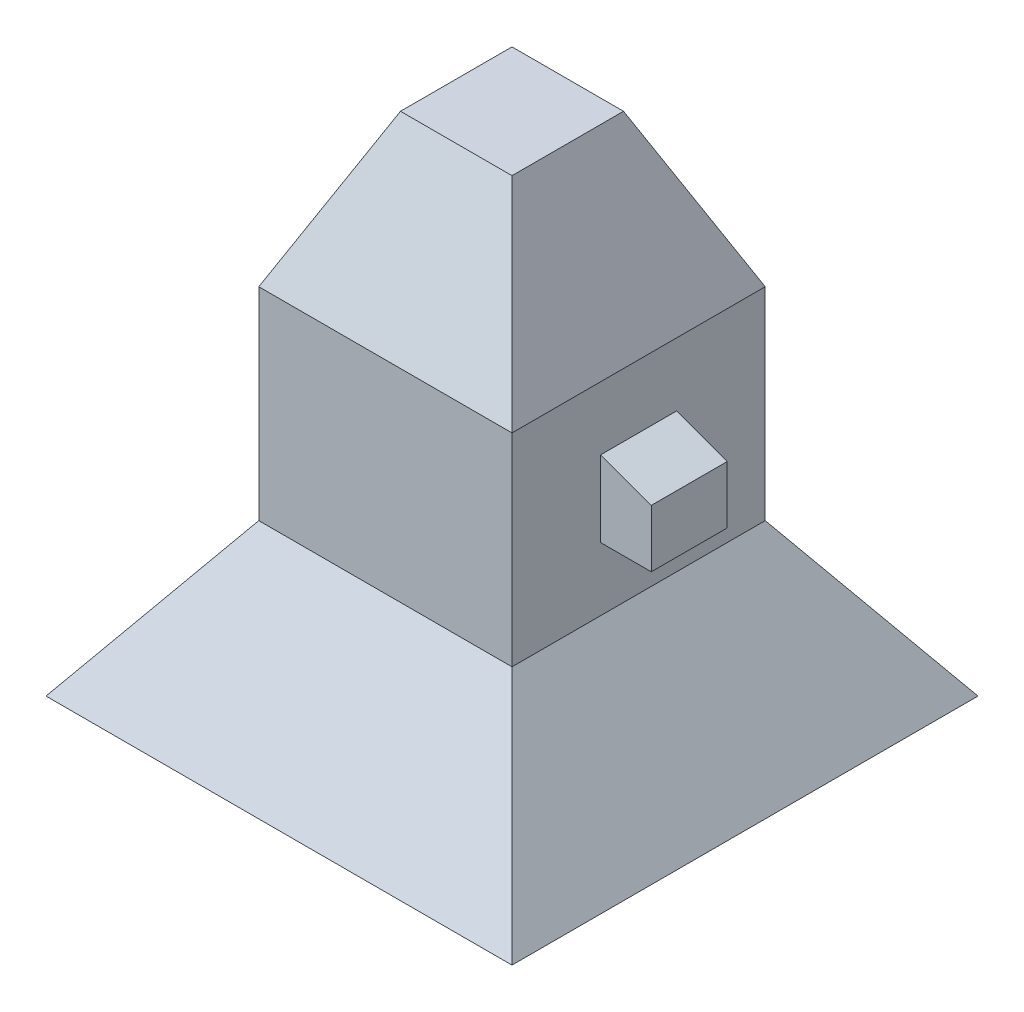
ISO-10303-21;
HEADER;
FILE_DESCRIPTION(('STEP AP214'),'2;1');
FILE_NAME('part.step','',(''),(''),'','','');
FILE_SCHEMA(('AUTOMOTIVE_DESIGN { 1 0 10303 214 1 1 1 1 }'));
ENDSEC;
DATA;
#1=APPLICATION_CONTEXT('core data for automotive mechanical design processes');
#2=APPLICATION_PROTOCOL_DEFINITION('international standard','automotive_design',2000,#1);
#3=PRODUCT_CONTEXT('',#1,'mechanical');
#4=PRODUCT('Part','Part','',(#3));
#5=PRODUCT_RELATED_PRODUCT_CATEGORY('part','',(#4));
#6=PRODUCT_DEFINITION_FORMATION('','',#4);
#7=PRODUCT_DEFINITION_CONTEXT('part definition',#1,'design');
#8=PRODUCT_DEFINITION('design','',#6,#7);
#9=PRODUCT_DEFINITION_SHAPE('','',#8);
#10=(LENGTH_UNIT() NAMED_UNIT(*) SI_UNIT(.MILLI.,.METRE.));
#11=(NAMED_UNIT(*) PLANE_ANGLE_UNIT() SI_UNIT($,.RADIAN.));
#12=(NAMED_UNIT(*) SI_UNIT($,.STERADIAN.) SOLID_ANGLE_UNIT());
#13=UNCERTAINTY_MEASURE_WITH_UNIT(LENGTH_MEASURE(1.E-05),#10,'distance_accuracy_value','');
#14=(GEOMETRIC_REPRESENTATION_CONTEXT(3) GLOBAL_UNCERTAINTY_ASSIGNED_CONTEXT((#13)) GLOBAL_UNIT_ASSIGNED_CONTEXT((#10,
#11,#12)) REPRESENTATION_CONTEXT('',''));
#15=CARTESIAN_POINT('',(0.,0.,0.));
#16=DIRECTION('',(0.,0.,1.));
#17=DIRECTION('',(1.,0.,0.));
#18=AXIS2_PLACEMENT_3D('',#15,#16,#17);
#19=CARTESIAN_POINT('',(2540.,2032.,0.));
#20=DIRECTION('',(-1.,0.,0.));
#21=DIRECTION('',(0.,0.,1.));
#22=AXIS2_PLACEMENT_3D('',#19,#20,#21);
#23=PLANE('',#22);
#24=DIRECTION('',(0.,0.,-1.));
#25=VECTOR('',#24,1.);
#26=CARTESIAN_POINT('',(2540.,0.,0.));
#27=LINE('',#26,#25);
#28=CARTESIAN_POINT('',(2540.,0.,0.));
#29=VERTEX_POINT('',#28);
#30=CARTESIAN_POINT('',(2540.,0.,-2540.));
#31=VERTEX_POINT('',#30);
#32=EDGE_CURVE('E263',#29,#31,#27,.T.);
#33=ORIENTED_EDGE('',*,*,#32,.T.);
#34=DIRECTION('',(0.,-1.,0.));
#35=VECTOR('',#34,1.);
#36=CARTESIAN_POINT('',(2540.,2032.,-2540.));
#37=LINE('',#36,#35);
#38=CARTESIAN_POINT('',(2540.,2032.,-2540.));
#39=VERTEX_POINT('',#38);
#40=EDGE_CURVE('E270',#39,#31,#37,.T.);
#41=ORIENTED_EDGE('',*,*,#40,.F.);
#42=DIRECTION('',(0.,0.,-1.));
#43=VECTOR('',#42,1.);
#44=CARTESIAN_POINT('',(2540.,2032.,0.));
#45=LINE('',#44,#43);
#46=CARTESIAN_POINT('',(2540.,2032.,0.));
#47=VERTEX_POINT('',#46);
#48=EDGE_CURVE('E251',#47,#39,#45,.T.);
#49=ORIENTED_EDGE('',*,*,#48,.F.);
#50=DIRECTION('',(0.,-1.,0.));
#51=VECTOR('',#50,1.);
#52=CARTESIAN_POINT('',(2540.,2032.,0.));
#53=LINE('',#52,#51);
#54=EDGE_CURVE('E43',#47,#29,#53,.T.);
#55=ORIENTED_EDGE('',*,*,#54,.T.);
#56=EDGE_LOOP('',(#33,#41,#49,#55));
#57=FACE_BOUND('',#56,.T.);
#58=DIRECTION('',(0.,1.,0.));
#59=VECTOR('',#58,1.);
#60=CARTESIAN_POINT('',(2540.,1397.,-1651.));
#61=LINE('',#60,#59);
#62=CARTESIAN_POINT('',(2540.,635.,-1651.));
#63=VERTEX_POINT('',#62);
#64=CARTESIAN_POINT('',(2540.,1397.,-1651.));
#65=VERTEX_POINT('',#64);
#66=EDGE_CURVE('E69',#63,#65,#61,.T.);
#67=ORIENTED_EDGE('',*,*,#66,.F.);
#68=DIRECTION('',(0.,0.,-1.));
#69=VECTOR('',#68,1.);
#70=CARTESIAN_POINT('',(2540.,635.,-889.));
#71=LINE('',#70,#69);
#72=CARTESIAN_POINT('',(2540.,635.,-889.));
#73=VERTEX_POINT('',#72);
#74=EDGE_CURVE('E146',#73,#63,#71,.T.);
#75=ORIENTED_EDGE('',*,*,#74,.F.);
#76=DIRECTION('',(0.,-1.,0.));
#77=VECTOR('',#76,1.);
#78=CARTESIAN_POINT('',(2540.,1397.,-889.));
#79=LINE('',#78,#77);
#80=CARTESIAN_POINT('',(2540.,1397.,-889.));
#81=VERTEX_POINT('',#80);
#82=EDGE_CURVE('E148',#81,#73,#79,.T.);
#83=ORIENTED_EDGE('',*,*,#82,.F.);
#84=DIRECTION('',(0.,0.,1.));
#85=VECTOR('',#84,1.);
#86=CARTESIAN_POINT('',(2540.,1397.,-889.));
#87=LINE('',#86,#85);
#88=EDGE_CURVE('E52',#65,#81,#87,.T.);
#89=ORIENTED_EDGE('',*,*,#88,.F.);
#90=EDGE_LOOP('',(#67,#75,#83,#89));
#91=FACE_BOUND('',#90,.T.);
#92=ADVANCED_FACE('F33',(#57,#91),#23,.F.);
#93=CARTESIAN_POINT('',(0.,2032.,0.));
#94=DIRECTION('',(1.,0.,0.));
#95=DIRECTION('',(0.,0.,-1.));
#96=AXIS2_PLACEMENT_3D('',#93,#94,#95);
#97=PLANE('',#96);
#98=DIRECTION('',(0.,0.,1.));
#99=VECTOR('',#98,1.);
#100=CARTESIAN_POINT('',(0.,0.,0.));
#101=LINE('',#100,#99);
#102=CARTESIAN_POINT('',(0.,0.,-2540.));
#103=VERTEX_POINT('',#102);
#104=CARTESIAN_POINT('',(0.,0.,0.));
#105=VERTEX_POINT('',#104);
#106=EDGE_CURVE('E226',#103,#105,#101,.T.);
#107=ORIENTED_EDGE('',*,*,#106,.T.);
#108=DIRECTION('',(0.,-1.,0.));
#109=VECTOR('',#108,1.);
#110=CARTESIAN_POINT('',(0.,2032.,0.));
#111=LINE('',#110,#109);
#112=CARTESIAN_POINT('',(0.,2032.,0.));
#113=VERTEX_POINT('',#112);
#114=EDGE_CURVE('E11',#113,#105,#111,.T.);
#115=ORIENTED_EDGE('',*,*,#114,.F.);
#116=DIRECTION('',(0.,0.,1.));
#117=VECTOR('',#116,1.);
#118=CARTESIAN_POINT('',(0.,2032.,0.));
#119=LINE('',#118,#117);
#120=CARTESIAN_POINT('',(0.,2032.,-2540.));
#121=VERTEX_POINT('',#120);
#122=EDGE_CURVE('E244',#121,#113,#119,.T.);
#123=ORIENTED_EDGE('',*,*,#122,.F.);
#124=DIRECTION('',(0.,-1.,0.));
#125=VECTOR('',#124,1.);
#126=CARTESIAN_POINT('',(0.,2032.,-2540.));
#127=LINE('',#126,#125);
#128=EDGE_CURVE('E257',#121,#103,#127,.T.);
#129=ORIENTED_EDGE('',*,*,#128,.T.);
#130=EDGE_LOOP('',(#107,#115,#123,#129));
#131=FACE_BOUND('',#130,.T.);
#132=ADVANCED_FACE('F295',(#131),#97,.F.);
#133=CARTESIAN_POINT('',(0.,2032.,0.));
#134=DIRECTION('',(0.,0.,-1.));
#135=DIRECTION('',(-1.,0.,0.));
#136=AXIS2_PLACEMENT_3D('',#133,#134,#135);
#137=PLANE('',#136);
#138=DIRECTION('',(1.,0.,0.));
#139=VECTOR('',#138,1.);
#140=CARTESIAN_POINT('',(0.,0.,0.));
#141=LINE('',#140,#139);
#142=EDGE_CURVE('E260',#105,#29,#141,.T.);
#143=ORIENTED_EDGE('',*,*,#142,.T.);
#144=ORIENTED_EDGE('',*,*,#54,.F.);
#145=DIRECTION('',(1.,0.,0.));
#146=VECTOR('',#145,1.);
#147=CARTESIAN_POINT('',(0.,2032.,0.));
#148=LINE('',#147,#146);
#149=EDGE_CURVE('E247',#113,#47,#148,.T.);
#150=ORIENTED_EDGE('',*,*,#149,.F.);
#151=ORIENTED_EDGE('',*,*,#114,.T.);
#152=EDGE_LOOP('',(#143,#144,#150,#151));
#153=FACE_BOUND('',#152,.T.);
#154=ADVANCED_FACE('F301',(#153),#137,.F.);
#155=CARTESIAN_POINT('',(0.,2032.,-2540.));
#156=DIRECTION('',(0.,0.,1.));
#157=DIRECTION('',(1.,0.,0.));
#158=AXIS2_PLACEMENT_3D('',#155,#156,#157);
#159=PLANE('',#158);
#160=DIRECTION('',(-1.,0.,0.));
#161=VECTOR('',#160,1.);
#162=CARTESIAN_POINT('',(0.,0.,-2540.));
#163=LINE('',#162,#161);
#164=EDGE_CURVE('E248',#31,#103,#163,.T.);
#165=ORIENTED_EDGE('',*,*,#164,.T.);
#166=ORIENTED_EDGE('',*,*,#128,.F.);
#167=DIRECTION('',(-1.,0.,0.));
#168=VECTOR('',#167,1.);
#169=CARTESIAN_POINT('',(0.,2032.,-2540.));
#170=LINE('',#169,#168);
#171=EDGE_CURVE('E254',#39,#121,#170,.T.);
#172=ORIENTED_EDGE('',*,*,#171,.F.);
#173=ORIENTED_EDGE('',*,*,#40,.T.);
#174=EDGE_LOOP('',(#165,#166,#172,#173));
#175=FACE_BOUND('',#174,.T.);
#176=ADVANCED_FACE('F305',(#175),#159,.F.);
#177=CARTESIAN_POINT('',(2540.,2032.,-2540.));
#178=DIRECTION('',(0.,0.4226182617407,-0.906307787036649));
#179=DIRECTION('',(0.,0.90630778703665,0.4226182617407));
#180=AXIS2_PLACEMENT_3D('',#177,#178,#179);
#181=PLANE('',#180);
#182=ORIENTED_EDGE('',*,*,#171,.T.);
#183=DIRECTION('',(-0.389281620635026,-0.834817129478987,-0.389281620635026));
#184=VECTOR('',#183,1.);
#185=CARTESIAN_POINT('',(0.,2032.,-2540.));
#186=LINE('',#185,#184);
#187=CARTESIAN_POINT('',(710.65287102822,3556.,-1829.34712897178));
#188=VERTEX_POINT('',#187);
#189=EDGE_CURVE('E223',#188,#121,#186,.T.);
#190=ORIENTED_EDGE('',*,*,#189,.F.);
#191=DIRECTION('',(1.,0.,0.));
#192=VECTOR('',#191,1.);
#193=CARTESIAN_POINT('',(2540.,3556.,-1829.34712897178));
#194=LINE('',#193,#192);
#195=CARTESIAN_POINT('',(1829.34712897178,3556.,-1829.34712897178));
#196=VERTEX_POINT('',#195);
#197=EDGE_CURVE('E206',#196,#188,#194,.F.);
#198=ORIENTED_EDGE('',*,*,#197,.F.);
#199=DIRECTION('',(0.389281620635026,-0.834817129478987,-0.389281620635026));
#200=VECTOR('',#199,1.);
#201=CARTESIAN_POINT('',(2540.,2032.,-2540.));
#202=LINE('',#201,#200);
#203=EDGE_CURVE('E228',#196,#39,#202,.T.);
#204=ORIENTED_EDGE('',*,*,#203,.T.);
#205=EDGE_LOOP('',(#182,#190,#198,#204));
#206=FACE_BOUND('',#205,.T.);
#207=ADVANCED_FACE('F312',(#206),#181,.T.);
#208=CARTESIAN_POINT('',(0.,2032.,-2540.));
#209=DIRECTION('',(-0.906307787036649,0.4226182617407,0.));
#210=DIRECTION('',(-0.4226182617407,-0.90630778703665,0.));
#211=AXIS2_PLACEMENT_3D('',#208,#209,#210);
#212=PLANE('',#211);
#213=ORIENTED_EDGE('',*,*,#122,.T.);
#214=DIRECTION('',(-0.389281620635026,-0.834817129478987,0.389281620635026));
#215=VECTOR('',#214,1.);
#216=CARTESIAN_POINT('',(0.,2032.,0.));
#217=LINE('',#216,#215);
#218=CARTESIAN_POINT('',(710.65287102822,3556.,-710.65287102822));
#219=VERTEX_POINT('',#218);
#220=EDGE_CURVE('E227',#219,#113,#217,.T.);
#221=ORIENTED_EDGE('',*,*,#220,.F.);
#222=DIRECTION('',(0.,0.,-1.));
#223=VECTOR('',#222,1.);
#224=CARTESIAN_POINT('',(710.65287102822,3556.,-2540.));
#225=LINE('',#224,#223);
#226=EDGE_CURVE('E239',#188,#219,#225,.F.);
#227=ORIENTED_EDGE('',*,*,#226,.F.);
#228=ORIENTED_EDGE('',*,*,#189,.T.);
#229=EDGE_LOOP('',(#213,#221,#227,#228));
#230=FACE_BOUND('',#229,.T.);
#231=ADVANCED_FACE('F335',(#230),#212,.T.);
#232=CARTESIAN_POINT('',(0.,2032.,0.));
#233=DIRECTION('',(0.,0.4226182617407,0.906307787036649));
#234=DIRECTION('',(0.,-0.90630778703665,0.4226182617407));
#235=AXIS2_PLACEMENT_3D('',#232,#233,#234);
#236=PLANE('',#235);
#237=ORIENTED_EDGE('',*,*,#149,.T.);
#238=DIRECTION('',(0.389281620635026,-0.834817129478987,0.389281620635026));
#239=VECTOR('',#238,1.);
#240=CARTESIAN_POINT('',(2540.,2032.,0.));
#241=LINE('',#240,#239);
#242=CARTESIAN_POINT('',(1829.34712897178,3556.,-710.65287102822));
#243=VERTEX_POINT('',#242);
#244=EDGE_CURVE('E231',#243,#47,#241,.T.);
#245=ORIENTED_EDGE('',*,*,#244,.F.);
#246=DIRECTION('',(-1.,0.,0.));
#247=VECTOR('',#246,1.);
#248=CARTESIAN_POINT('',(0.,3556.,-710.65287102822));
#249=LINE('',#248,#247);
#250=EDGE_CURVE('E241',#219,#243,#249,.F.);
#251=ORIENTED_EDGE('',*,*,#250,.F.);
#252=ORIENTED_EDGE('',*,*,#220,.T.);
#253=EDGE_LOOP('',(#237,#245,#251,#252));
#254=FACE_BOUND('',#253,.T.);
#255=ADVANCED_FACE('F325',(#254),#236,.T.);
#256=CARTESIAN_POINT('',(2540.,2032.,0.));
#257=DIRECTION('',(0.906307787036649,0.4226182617407,0.));
#258=DIRECTION('',(-0.4226182617407,0.90630778703665,0.));
#259=AXIS2_PLACEMENT_3D('',#256,#257,#258);
#260=PLANE('',#259);
#261=ORIENTED_EDGE('',*,*,#48,.T.);
#262=ORIENTED_EDGE('',*,*,#203,.F.);
#263=DIRECTION('',(0.,0.,1.));
#264=VECTOR('',#263,1.);
#265=CARTESIAN_POINT('',(1829.34712897178,3556.,0.));
#266=LINE('',#265,#264);
#267=EDGE_CURVE('E232',#243,#196,#266,.F.);
#268=ORIENTED_EDGE('',*,*,#267,.F.);
#269=ORIENTED_EDGE('',*,*,#244,.T.);
#270=EDGE_LOOP('',(#261,#262,#268,#269));
#271=FACE_BOUND('',#270,.T.);
#272=ADVANCED_FACE('F329',(#271),#260,.T.);
#273=CARTESIAN_POINT('',(0.,3556.,0.));
#274=DIRECTION('',(0.,1.,0.));
#275=DIRECTION('',(0.,0.,1.));
#276=AXIS2_PLACEMENT_3D('',#273,#274,#275);
#277=PLANE('',#276);
#278=ORIENTED_EDGE('',*,*,#197,.T.);
#279=ORIENTED_EDGE('',*,*,#226,.T.);
#280=ORIENTED_EDGE('',*,*,#250,.T.);
#281=ORIENTED_EDGE('',*,*,#267,.T.);
#282=EDGE_LOOP('',(#278,#279,#280,#281));
#283=FACE_BOUND('',#282,.T.);
#284=ADVANCED_FACE('F332',(#283),#277,.T.);
#285=CARTESIAN_POINT('',(2540.,0.,0.));
#286=DIRECTION('',(0.,0.573576436351047,0.819152044288991));
#287=DIRECTION('',(0.,-0.819152044288991,0.573576436351047));
#288=AXIS2_PLACEMENT_3D('',#285,#286,#287);
#289=PLANE('',#288);
#290=ORIENTED_EDGE('',*,*,#142,.F.);
#291=DIRECTION('',(0.497542812164524,0.710564775461629,-0.497542812164524));
#292=VECTOR('',#291,1.);
#293=CARTESIAN_POINT('',(0.,0.,0.));
#294=LINE('',#293,#292);
#295=CARTESIAN_POINT('',(-1067.1162882316,-1524.,1067.1162882316));
#296=VERTEX_POINT('',#295);
#297=EDGE_CURVE('E204',#296,#105,#294,.T.);
#298=ORIENTED_EDGE('',*,*,#297,.F.);
#299=DIRECTION('',(1.,0.,0.));
#300=VECTOR('',#299,1.);
#301=CARTESIAN_POINT('',(2540.,-1524.,1067.1162882316));
#302=LINE('',#301,#300);
#303=CARTESIAN_POINT('',(3607.1162882316,-1524.,1067.1162882316));
#304=VERTEX_POINT('',#303);
#305=EDGE_CURVE('E185',#304,#296,#302,.F.);
#306=ORIENTED_EDGE('',*,*,#305,.F.);
#307=DIRECTION('',(-0.497542812164524,0.710564775461629,-0.497542812164524));
#308=VECTOR('',#307,1.);
#309=CARTESIAN_POINT('',(2540.,0.,0.));
#310=LINE('',#309,#308);
#311=EDGE_CURVE('E208',#304,#29,#310,.T.);
#312=ORIENTED_EDGE('',*,*,#311,.T.);
#313=EDGE_LOOP('',(#290,#298,#306,#312));
#314=FACE_BOUND('',#313,.T.);
#315=ADVANCED_FACE('F351',(#314),#289,.T.);
#316=CARTESIAN_POINT('',(0.,0.,0.));
#317=DIRECTION('',(-0.819152044288991,0.573576436351047,0.));
#318=DIRECTION('',(-0.573576436351047,-0.819152044288991,0.));
#319=AXIS2_PLACEMENT_3D('',#316,#317,#318);
#320=PLANE('',#319);
#321=ORIENTED_EDGE('',*,*,#106,.F.);
#322=DIRECTION('',(0.497542812164524,0.710564775461629,0.497542812164524));
#323=VECTOR('',#322,1.);
#324=CARTESIAN_POINT('',(0.,0.,-2540.));
#325=LINE('',#324,#323);
#326=CARTESIAN_POINT('',(-1067.1162882316,-1524.,-3607.1162882316));
#327=VERTEX_POINT('',#326);
#328=EDGE_CURVE('E207',#327,#103,#325,.T.);
#329=ORIENTED_EDGE('',*,*,#328,.F.);
#330=DIRECTION('',(0.,0.,1.));
#331=VECTOR('',#330,1.);
#332=CARTESIAN_POINT('',(-1067.1162882316,-1524.,0.));
#333=LINE('',#332,#331);
#334=EDGE_CURVE('E218',#296,#327,#333,.F.);
#335=ORIENTED_EDGE('',*,*,#334,.F.);
#336=ORIENTED_EDGE('',*,*,#297,.T.);
#337=EDGE_LOOP('',(#321,#329,#335,#336));
#338=FACE_BOUND('',#337,.T.);
#339=ADVANCED_FACE('F350',(#338),#320,.T.);
#340=CARTESIAN_POINT('',(0.,0.,-2540.));
#341=DIRECTION('',(0.,0.573576436351047,-0.819152044288991));
#342=DIRECTION('',(0.,0.819152044288991,0.573576436351047));
#343=AXIS2_PLACEMENT_3D('',#340,#341,#342);
#344=PLANE('',#343);
#345=ORIENTED_EDGE('',*,*,#164,.F.);
#346=DIRECTION('',(-0.497542812164524,0.710564775461629,0.497542812164524));
#347=VECTOR('',#346,1.);
#348=CARTESIAN_POINT('',(2540.,0.,-2540.));
#349=LINE('',#348,#347);
#350=CARTESIAN_POINT('',(3607.1162882316,-1524.,-3607.1162882316));
#351=VERTEX_POINT('',#350);
#352=EDGE_CURVE('E210',#351,#31,#349,.T.);
#353=ORIENTED_EDGE('',*,*,#352,.F.);
#354=DIRECTION('',(-1.,0.,0.));
#355=VECTOR('',#354,1.);
#356=CARTESIAN_POINT('',(0.,-1524.,-3607.1162882316));
#357=LINE('',#356,#355);
#358=EDGE_CURVE('E220',#327,#351,#357,.F.);
#359=ORIENTED_EDGE('',*,*,#358,.F.);
#360=ORIENTED_EDGE('',*,*,#328,.T.);
#361=EDGE_LOOP('',(#345,#353,#359,#360));
#362=FACE_BOUND('',#361,.T.);
#363=ADVANCED_FACE('F339',(#362),#344,.T.);
#364=CARTESIAN_POINT('',(2540.,0.,-2540.));
#365=DIRECTION('',(0.819152044288991,0.573576436351047,0.));
#366=DIRECTION('',(-0.573576436351047,0.819152044288991,0.));
#367=AXIS2_PLACEMENT_3D('',#364,#365,#366);
#368=PLANE('',#367);
#369=ORIENTED_EDGE('',*,*,#32,.F.);
#370=ORIENTED_EDGE('',*,*,#311,.F.);
#371=DIRECTION('',(0.,0.,-1.));
#372=VECTOR('',#371,1.);
#373=CARTESIAN_POINT('',(3607.1162882316,-1524.,-2540.));
#374=LINE('',#373,#372);
#375=EDGE_CURVE('E211',#351,#304,#374,.F.);
#376=ORIENTED_EDGE('',*,*,#375,.F.);
#377=ORIENTED_EDGE('',*,*,#352,.T.);
#378=EDGE_LOOP('',(#369,#370,#376,#377));
#379=FACE_BOUND('',#378,.T.);
#380=ADVANCED_FACE('F344',(#379),#368,.T.);
#381=CARTESIAN_POINT('',(0.,-1524.,0.));
#382=DIRECTION('',(0.,-1.,0.));
#383=DIRECTION('',(0.,0.,-1.));
#384=AXIS2_PLACEMENT_3D('',#381,#382,#383);
#385=PLANE('',#384);
#386=DIRECTION('',(0.,0.,-1.));
#387=VECTOR('',#386,1.);
#388=CARTESIAN_POINT('',(-559.116288231601,-1524.,559.116288231601));
#389=LINE('',#388,#387);
#390=CARTESIAN_POINT('',(-559.116288231601,-1524.,559.116288231601));
#391=VERTEX_POINT('',#390);
#392=CARTESIAN_POINT('',(-559.1162882316,-1524.,-3099.1162882316));
#393=VERTEX_POINT('',#392);
#394=EDGE_CURVE('E171',#391,#393,#389,.T.);
#395=ORIENTED_EDGE('',*,*,#394,.F.);
#396=DIRECTION('',(-1.,0.,0.));
#397=VECTOR('',#396,1.);
#398=CARTESIAN_POINT('',(-559.116288231601,-1524.,559.116288231601));
#399=LINE('',#398,#397);
#400=CARTESIAN_POINT('',(3099.1162882316,-1524.,559.116288231601));
#401=VERTEX_POINT('',#400);
#402=EDGE_CURVE('E179',#401,#391,#399,.T.);
#403=ORIENTED_EDGE('',*,*,#402,.F.);
#404=DIRECTION('',(0.,0.,1.));
#405=VECTOR('',#404,1.);
#406=CARTESIAN_POINT('',(3099.1162882316,-1524.,559.116288231601));
#407=LINE('',#406,#405);
#408=CARTESIAN_POINT('',(3099.1162882316,-1524.,-3099.1162882316));
#409=VERTEX_POINT('',#408);
#410=EDGE_CURVE('E176',#409,#401,#407,.T.);
#411=ORIENTED_EDGE('',*,*,#410,.F.);
#412=DIRECTION('',(1.,0.,0.));
#413=VECTOR('',#412,1.);
#414=CARTESIAN_POINT('',(-559.1162882316,-1524.,-3099.1162882316));
#415=LINE('',#414,#413);
#416=EDGE_CURVE('E173',#393,#409,#415,.T.);
#417=ORIENTED_EDGE('',*,*,#416,.F.);
#418=EDGE_LOOP('',(#395,#403,#411,#417));
#419=FACE_BOUND('',#418,.T.);
#420=ORIENTED_EDGE('',*,*,#305,.T.);
#421=ORIENTED_EDGE('',*,*,#334,.T.);
#422=ORIENTED_EDGE('',*,*,#358,.T.);
#423=ORIENTED_EDGE('',*,*,#375,.T.);
#424=EDGE_LOOP('',(#420,#421,#422,#423));
#425=FACE_BOUND('',#424,.T.);
#426=ADVANCED_FACE('F348',(#419,#425),#385,.T.);
#427=CARTESIAN_POINT('',(-559.116288231601,-1524.,559.116288231601));
#428=DIRECTION('',(-0.819152044288991,0.573576436351047,0.));
#429=DIRECTION('',(-0.573576436351047,-0.819152044288991,0.));
#430=AXIS2_PLACEMENT_3D('',#427,#428,#429);
#431=PLANE('',#430);
#432=ORIENTED_EDGE('',*,*,#394,.T.);
#433=DIRECTION('',(-0.497542812164524,-0.710564775461629,-0.497542812164524));
#434=VECTOR('',#433,1.);
#435=CARTESIAN_POINT('',(346.474978872406,-230.681636962351,-2193.52502112759));
#436=LINE('',#435,#434);
#437=CARTESIAN_POINT('',(-203.410858821066,-1016.,-2743.41085882107));
#438=VERTEX_POINT('',#437);
#439=EDGE_CURVE('E187',#438,#393,#436,.T.);
#440=ORIENTED_EDGE('',*,*,#439,.F.);
#441=DIRECTION('',(0.,0.,-1.));
#442=VECTOR('',#441,1.);
#443=CARTESIAN_POINT('',(-203.410858821067,-1016.,0.));
#444=LINE('',#443,#442);
#445=CARTESIAN_POINT('',(-203.410858821068,-1016.,203.410858821068));
#446=VERTEX_POINT('',#445);
#447=EDGE_CURVE('E182',#446,#438,#444,.T.);
#448=ORIENTED_EDGE('',*,*,#447,.F.);
#449=DIRECTION('',(-0.497542812164524,-0.710564775461629,0.497542812164524));
#450=VECTOR('',#449,1.);
#451=CARTESIAN_POINT('',(-559.116288231601,-1524.,559.116288231601));
#452=LINE('',#451,#450);
#453=EDGE_CURVE('E183',#446,#391,#452,.T.);
#454=ORIENTED_EDGE('',*,*,#453,.T.);
#455=EDGE_LOOP('',(#432,#440,#448,#454));
#456=FACE_BOUND('',#455,.T.);
#457=ADVANCED_FACE('F438',(#456),#431,.F.);
#458=CARTESIAN_POINT('',(-559.116288231601,-1524.,559.116288231601));
#459=DIRECTION('',(0.,0.573576436351047,0.819152044288991));
#460=DIRECTION('',(0.,-0.819152044288991,0.573576436351047));
#461=AXIS2_PLACEMENT_3D('',#458,#459,#460);
#462=PLANE('',#461);
#463=ORIENTED_EDGE('',*,*,#402,.T.);
#464=ORIENTED_EDGE('',*,*,#453,.F.);
#465=DIRECTION('',(-1.,0.,0.));
#466=VECTOR('',#465,1.);
#467=CARTESIAN_POINT('',(0.,-1016.,203.410858821067));
#468=LINE('',#467,#466);
#469=CARTESIAN_POINT('',(2743.41085882107,-1016.,203.410858821067));
#470=VERTEX_POINT('',#469);
#471=EDGE_CURVE('E191',#470,#446,#468,.T.);
#472=ORIENTED_EDGE('',*,*,#471,.F.);
#473=DIRECTION('',(0.497542812164524,-0.710564775461629,0.497542812164524));
#474=VECTOR('',#473,1.);
#475=CARTESIAN_POINT('',(3099.1162882316,-1524.,559.116288231601));
#476=LINE('',#475,#474);
#477=EDGE_CURVE('E186',#470,#401,#476,.T.);
#478=ORIENTED_EDGE('',*,*,#477,.T.);
#479=EDGE_LOOP('',(#463,#464,#472,#478));
#480=FACE_BOUND('',#479,.T.);
#481=ADVANCED_FACE('F447',(#480),#462,.F.);
#482=CARTESIAN_POINT('',(3099.1162882316,-1524.,559.116288231601));
#483=DIRECTION('',(0.819152044288991,0.573576436351047,0.));
#484=DIRECTION('',(-0.573576436351047,0.819152044288991,0.));
#485=AXIS2_PLACEMENT_3D('',#482,#483,#484);
#486=PLANE('',#485);
#487=ORIENTED_EDGE('',*,*,#410,.T.);
#488=ORIENTED_EDGE('',*,*,#477,.F.);
#489=DIRECTION('',(0.,0.,1.));
#490=VECTOR('',#489,1.);
#491=CARTESIAN_POINT('',(2743.41085882107,-1016.,3.33034911018644E-13));
#492=LINE('',#491,#490);
#493=CARTESIAN_POINT('',(2743.41085882107,-1016.,-2743.41085882107));
#494=VERTEX_POINT('',#493);
#495=EDGE_CURVE('E199',#494,#470,#492,.T.);
#496=ORIENTED_EDGE('',*,*,#495,.F.);
#497=DIRECTION('',(0.497542812164524,-0.710564775461629,-0.497542812164524));
#498=VECTOR('',#497,1.);
#499=CARTESIAN_POINT('',(2193.52502112759,-230.681636962351,-2193.52502112759));
#500=LINE('',#499,#498);
#501=EDGE_CURVE('E190',#494,#409,#500,.T.);
#502=ORIENTED_EDGE('',*,*,#501,.T.);
#503=EDGE_LOOP('',(#487,#488,#496,#502));
#504=FACE_BOUND('',#503,.T.);
#505=ADVANCED_FACE('F457',(#504),#486,.F.);
#506=CARTESIAN_POINT('',(-559.1162882316,-1524.,-3099.1162882316));
#507=DIRECTION('',(0.,0.573576436351047,-0.819152044288991));
#508=DIRECTION('',(0.,0.819152044288991,0.573576436351047));
#509=AXIS2_PLACEMENT_3D('',#506,#507,#508);
#510=PLANE('',#509);
#511=ORIENTED_EDGE('',*,*,#416,.T.);
#512=ORIENTED_EDGE('',*,*,#501,.F.);
#513=DIRECTION('',(1.,0.,0.));
#514=VECTOR('',#513,1.);
#515=CARTESIAN_POINT('',(-3.33034911018645E-13,-1016.,-2743.41085882107));
#516=LINE('',#515,#514);
#517=EDGE_CURVE('E196',#438,#494,#516,.T.);
#518=ORIENTED_EDGE('',*,*,#517,.F.);
#519=ORIENTED_EDGE('',*,*,#439,.T.);
#520=EDGE_LOOP('',(#511,#512,#518,#519));
#521=FACE_BOUND('',#520,.T.);
#522=ADVANCED_FACE('F466',(#521),#510,.F.);
#523=CARTESIAN_POINT('',(0.,-1016.,0.));
#524=DIRECTION('',(0.,-1.,0.));
#525=DIRECTION('',(0.,0.,-1.));
#526=AXIS2_PLACEMENT_3D('',#523,#524,#525);
#527=PLANE('',#526);
#528=ORIENTED_EDGE('',*,*,#447,.T.);
#529=ORIENTED_EDGE('',*,*,#517,.T.);
#530=ORIENTED_EDGE('',*,*,#495,.T.);
#531=ORIENTED_EDGE('',*,*,#471,.T.);
#532=EDGE_LOOP('',(#528,#529,#530,#531));
#533=FACE_BOUND('',#532,.T.);
#534=ADVANCED_FACE('F476',(#533),#527,.T.);
#535=CARTESIAN_POINT('',(3048.,1397.,-1651.));
#536=DIRECTION('',(0.,0.,1.));
#537=DIRECTION('',(1.,0.,0.));
#538=AXIS2_PLACEMENT_3D('',#535,#536,#537);
#539=PLANE('',#538);
#540=ORIENTED_EDGE('',*,*,#66,.T.);
#541=DIRECTION('',(0.939692620785908,-0.342020143325669,0.));
#542=VECTOR('',#541,1.);
#543=CARTESIAN_POINT('',(2540.,1397.,-1651.));
#544=LINE('',#543,#542);
#545=CARTESIAN_POINT('',(3048.,1212.10312099277,-1651.));
#546=VERTEX_POINT('',#545);
#547=EDGE_CURVE('E168',#546,#65,#544,.F.);
#548=ORIENTED_EDGE('',*,*,#547,.F.);
#549=DIRECTION('',(0.,1.,0.));
#550=VECTOR('',#549,1.);
#551=CARTESIAN_POINT('',(3048.,1397.,-1651.));
#552=LINE('',#551,#550);
#553=CARTESIAN_POINT('',(3048.,635.,-1651.));
#554=VERTEX_POINT('',#553);
#555=EDGE_CURVE('E153',#554,#546,#552,.T.);
#556=ORIENTED_EDGE('',*,*,#555,.F.);
#557=DIRECTION('',(-1.,0.,0.));
#558=VECTOR('',#557,1.);
#559=CARTESIAN_POINT('',(3048.,635.,-1651.));
#560=LINE('',#559,#558);
#561=EDGE_CURVE('E166',#554,#63,#560,.T.);
#562=ORIENTED_EDGE('',*,*,#561,.T.);
#563=EDGE_LOOP('',(#540,#548,#556,#562));
#564=FACE_BOUND('',#563,.T.);
#565=ADVANCED_FACE('F286',(#564),#539,.F.);
#566=CARTESIAN_POINT('',(2540.,1397.,-889.));
#567=DIRECTION('',(0.342020143325669,0.939692620785908,0.));
#568=DIRECTION('',(-0.939692620785908,0.342020143325669,0.));
#569=AXIS2_PLACEMENT_3D('',#566,#567,#568);
#570=PLANE('',#569);
#571=ORIENTED_EDGE('',*,*,#88,.T.);
#572=DIRECTION('',(0.939692620785908,-0.342020143325669,0.));
#573=VECTOR('',#572,1.);
#574=CARTESIAN_POINT('',(2988.57528855222,1233.73194713962,-889.));
#575=LINE('',#574,#573);
#576=CARTESIAN_POINT('',(3048.,1212.10312099277,-889.));
#577=VERTEX_POINT('',#576);
#578=EDGE_CURVE('E37',#577,#81,#575,.F.);
#579=ORIENTED_EDGE('',*,*,#578,.F.);
#580=DIRECTION('',(0.,0.,-1.));
#581=VECTOR('',#580,1.);
#582=CARTESIAN_POINT('',(3048.,1212.10312099277,-889.));
#583=LINE('',#582,#581);
#584=EDGE_CURVE('E63',#546,#577,#583,.F.);
#585=ORIENTED_EDGE('',*,*,#584,.F.);
#586=ORIENTED_EDGE('',*,*,#547,.T.);
#587=EDGE_LOOP('',(#571,#579,#585,#586));
#588=FACE_BOUND('',#587,.T.);
#589=ADVANCED_FACE('F35',(#588),#570,.T.);
#590=CARTESIAN_POINT('',(3048.,1397.,-889.));
#591=DIRECTION('',(0.,0.,-1.));
#592=DIRECTION('',(0.,1.,0.));
#593=AXIS2_PLACEMENT_3D('',#590,#591,#592);
#594=PLANE('',#593);
#595=ORIENTED_EDGE('',*,*,#82,.T.);
#596=DIRECTION('',(-1.,0.,0.));
#597=VECTOR('',#596,1.);
#598=CARTESIAN_POINT('',(3048.,635.,-889.));
#599=LINE('',#598,#597);
#600=CARTESIAN_POINT('',(3048.,635.,-889.));
#601=VERTEX_POINT('',#600);
#602=EDGE_CURVE('E160',#601,#73,#599,.T.);
#603=ORIENTED_EDGE('',*,*,#602,.F.);
#604=DIRECTION('',(0.,-1.,0.));
#605=VECTOR('',#604,1.);
#606=CARTESIAN_POINT('',(3048.,1397.,-889.));
#607=LINE('',#606,#605);
#608=EDGE_CURVE('E275',#577,#601,#607,.T.);
#609=ORIENTED_EDGE('',*,*,#608,.F.);
#610=ORIENTED_EDGE('',*,*,#578,.T.);
#611=EDGE_LOOP('',(#595,#603,#609,#610));
#612=FACE_BOUND('',#611,.T.);
#613=ADVANCED_FACE('F158',(#612),#594,.F.);
#614=CARTESIAN_POINT('',(3048.,635.,-889.));
#615=DIRECTION('',(0.,1.,0.));
#616=DIRECTION('',(0.,0.,1.));
#617=AXIS2_PLACEMENT_3D('',#614,#615,#616);
#618=PLANE('',#617);
#619=ORIENTED_EDGE('',*,*,#74,.T.);
#620=ORIENTED_EDGE('',*,*,#561,.F.);
#621=DIRECTION('',(0.,0.,-1.));
#622=VECTOR('',#621,1.);
#623=CARTESIAN_POINT('',(3048.,635.,-889.));
#624=LINE('',#623,#622);
#625=EDGE_CURVE('E165',#601,#554,#624,.T.);
#626=ORIENTED_EDGE('',*,*,#625,.F.);
#627=ORIENTED_EDGE('',*,*,#602,.T.);
#628=EDGE_LOOP('',(#619,#620,#626,#627));
#629=FACE_BOUND('',#628,.T.);
#630=ADVANCED_FACE('F163',(#629),#618,.F.);
#631=CARTESIAN_POINT('',(3048.,0.,0.));
#632=DIRECTION('',(1.,0.,0.));
#633=DIRECTION('',(0.,0.,-1.));
#634=AXIS2_PLACEMENT_3D('',#631,#632,#633);
#635=PLANE('',#634);
#636=ORIENTED_EDGE('',*,*,#555,.T.);
#637=ORIENTED_EDGE('',*,*,#584,.T.);
#638=ORIENTED_EDGE('',*,*,#608,.T.);
#639=ORIENTED_EDGE('',*,*,#625,.T.);
#640=EDGE_LOOP('',(#636,#637,#638,#639));
#641=FACE_BOUND('',#640,.T.);
#642=ADVANCED_FACE('F287',(#641),#635,.T.);
#643=CLOSED_SHELL('',(#92,#132,#154,#176,#207,#231,#255,#272,#284,#315,#339,#363,#380,#426,#457,
#481,#505,#522,#534,#565,#589,#613,#630,#642));
#644=MANIFOLD_SOLID_BREP('B2',#643);
#645=ADVANCED_BREP_SHAPE_REPRESENTATION('',(#18,#644),#14);
#646=SHAPE_DEFINITION_REPRESENTATION(#9,#645);
ENDSEC;
END-ISO-10303-21;
